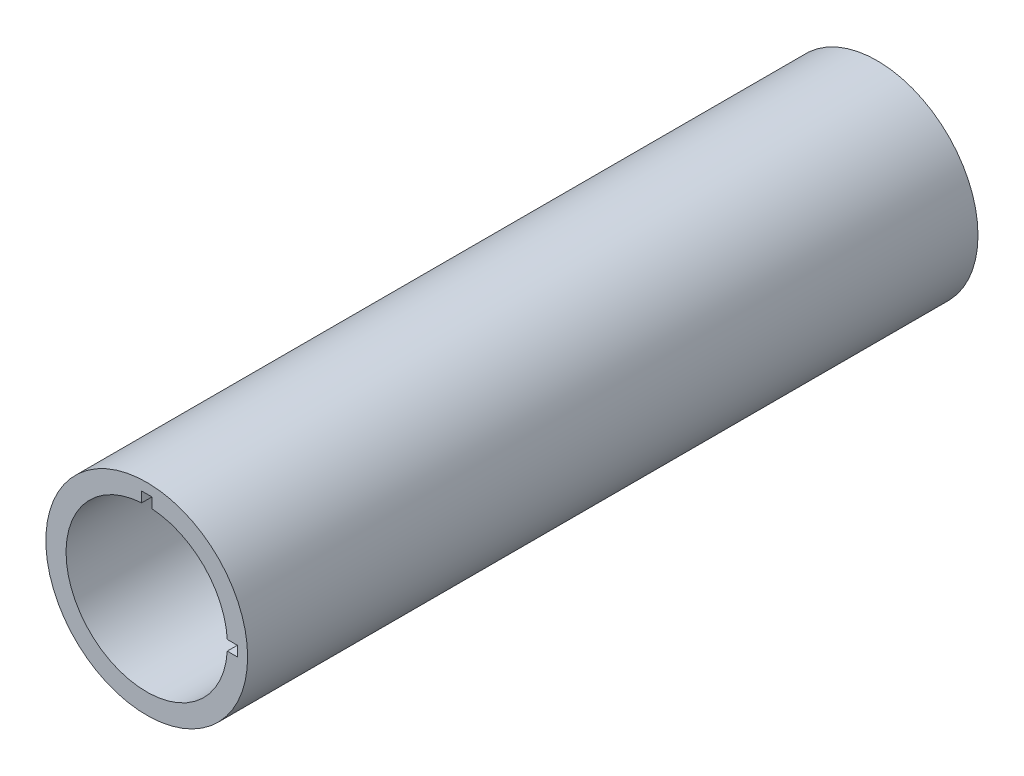
ISO-10303-21;
HEADER;
FILE_DESCRIPTION(('STEP AP214'),'2;1');
FILE_NAME('part.step','',(''),(''),'','','');
FILE_SCHEMA(('AUTOMOTIVE_DESIGN { 1 0 10303 214 1 1 1 1 }'));
ENDSEC;
DATA;
#1=APPLICATION_CONTEXT('core data for automotive mechanical design processes');
#2=APPLICATION_PROTOCOL_DEFINITION('international standard','automotive_design',2000,#1);
#3=PRODUCT_CONTEXT('',#1,'mechanical');
#4=PRODUCT('Part','Part','',(#3));
#5=PRODUCT_RELATED_PRODUCT_CATEGORY('part','',(#4));
#6=PRODUCT_DEFINITION_FORMATION('','',#4);
#7=PRODUCT_DEFINITION_CONTEXT('part definition',#1,'design');
#8=PRODUCT_DEFINITION('design','',#6,#7);
#9=PRODUCT_DEFINITION_SHAPE('','',#8);
#10=(LENGTH_UNIT() NAMED_UNIT(*) SI_UNIT(.MILLI.,.METRE.));
#11=(NAMED_UNIT(*) PLANE_ANGLE_UNIT() SI_UNIT($,.RADIAN.));
#12=(NAMED_UNIT(*) SI_UNIT($,.STERADIAN.) SOLID_ANGLE_UNIT());
#13=UNCERTAINTY_MEASURE_WITH_UNIT(LENGTH_MEASURE(1.E-05),#10,'distance_accuracy_value','');
#14=(GEOMETRIC_REPRESENTATION_CONTEXT(3) GLOBAL_UNCERTAINTY_ASSIGNED_CONTEXT((#13)) GLOBAL_UNIT_ASSIGNED_CONTEXT((#10,
#11,#12)) REPRESENTATION_CONTEXT('',''));
#15=CARTESIAN_POINT('',(0.,0.,0.));
#16=DIRECTION('',(0.,0.,1.));
#17=DIRECTION('',(1.,0.,0.));
#18=AXIS2_PLACEMENT_3D('',#15,#16,#17);
#19=CARTESIAN_POINT('',(0.,0.,181.));
#20=DIRECTION('',(0.,0.,1.));
#21=DIRECTION('',(1.,0.,0.));
#22=AXIS2_PLACEMENT_3D('',#19,#20,#21);
#23=PLANE('',#22);
#24=DIRECTION('',(-1.,0.,0.));
#25=VECTOR('',#24,1.);
#26=CARTESIAN_POINT('',(0.,1.25,181.));
#27=LINE('',#26,#25);
#28=CARTESIAN_POINT('',(22.5,1.24999999999992,181.));
#29=VERTEX_POINT('',#28);
#30=CARTESIAN_POINT('',(19.9608992783391,1.24999999999993,181.));
#31=VERTEX_POINT('',#30);
#32=EDGE_CURVE('E125',#29,#31,#27,.T.);
#33=ORIENTED_EDGE('',*,*,#32,.F.);
#34=DIRECTION('',(0.,-1.,0.));
#35=VECTOR('',#34,1.);
#36=CARTESIAN_POINT('',(22.5,0.,181.));
#37=LINE('',#36,#35);
#38=CARTESIAN_POINT('',(22.5,-1.25000000000008,181.));
#39=VERTEX_POINT('',#38);
#40=EDGE_CURVE('E11',#29,#39,#37,.T.);
#41=ORIENTED_EDGE('',*,*,#40,.T.);
#42=DIRECTION('',(1.,0.,0.));
#43=VECTOR('',#42,1.);
#44=CARTESIAN_POINT('',(0.,-1.25,181.));
#45=LINE('',#44,#43);
#46=CARTESIAN_POINT('',(19.9608992783391,-1.25000000000007,181.));
#47=VERTEX_POINT('',#46);
#48=EDGE_CURVE('E113',#47,#39,#45,.T.);
#49=ORIENTED_EDGE('',*,*,#48,.F.);
#50=CARTESIAN_POINT('',(0.,0.,181.));
#51=DIRECTION('',(0.,0.,1.));
#52=DIRECTION('',(1.,0.,0.));
#53=AXIS2_PLACEMENT_3D('',#50,#51,#52);
#54=CIRCLE('',#53,20.);
#55=CARTESIAN_POINT('',(-1.25,19.9608992783391,181.));
#56=VERTEX_POINT('',#55);
#57=EDGE_CURVE('E143',#56,#47,#54,.T.);
#58=ORIENTED_EDGE('',*,*,#57,.F.);
#59=DIRECTION('',(0.,-1.,0.));
#60=VECTOR('',#59,1.);
#61=CARTESIAN_POINT('',(-1.25,0.,181.));
#62=LINE('',#61,#60);
#63=CARTESIAN_POINT('',(-1.25,22.5,181.));
#64=VERTEX_POINT('',#63);
#65=EDGE_CURVE('E140',#64,#56,#62,.T.);
#66=ORIENTED_EDGE('',*,*,#65,.F.);
#67=DIRECTION('',(1.,0.,0.));
#68=VECTOR('',#67,1.);
#69=CARTESIAN_POINT('',(0.,22.5,181.));
#70=LINE('',#69,#68);
#71=CARTESIAN_POINT('',(1.25,22.5,181.));
#72=VERTEX_POINT('',#71);
#73=EDGE_CURVE('E161',#64,#72,#70,.T.);
#74=ORIENTED_EDGE('',*,*,#73,.T.);
#75=DIRECTION('',(0.,1.,0.));
#76=VECTOR('',#75,1.);
#77=CARTESIAN_POINT('',(1.25,0.,181.));
#78=LINE('',#77,#76);
#79=CARTESIAN_POINT('',(1.25,19.9608992783391,181.));
#80=VERTEX_POINT('',#79);
#81=EDGE_CURVE('E137',#80,#72,#78,.T.);
#82=ORIENTED_EDGE('',*,*,#81,.F.);
#83=EDGE_CURVE('E147',#31,#80,#54,.T.);
#84=ORIENTED_EDGE('',*,*,#83,.F.);
#85=EDGE_LOOP('',(#33,#41,#49,#58,#66,#74,#82,#84));
#86=FACE_BOUND('',#85,.T.);
#87=CARTESIAN_POINT('',(0.,0.,181.));
#88=DIRECTION('',(0.,0.,1.));
#89=DIRECTION('',(1.,0.,0.));
#90=AXIS2_PLACEMENT_3D('',#87,#88,#89);
#91=CIRCLE('',#90,25.);
#92=CARTESIAN_POINT('',(25.,0.,181.));
#93=VERTEX_POINT('',#92);
#94=EDGE_CURVE('E150',#93,#93,#91,.T.);
#95=ORIENTED_EDGE('',*,*,#94,.T.);
#96=EDGE_LOOP('',(#95));
#97=FACE_BOUND('',#96,.T.);
#98=ADVANCED_FACE('F35',(#86,#97),#23,.T.);
#99=CARTESIAN_POINT('',(0.,0.,0.));
#100=DIRECTION('',(0.,0.,1.));
#101=DIRECTION('',(1.,0.,0.));
#102=AXIS2_PLACEMENT_3D('',#99,#100,#101);
#103=PLANE('',#102);
#104=CARTESIAN_POINT('',(0.,0.,0.));
#105=DIRECTION('',(0.,0.,1.));
#106=DIRECTION('',(1.,0.,0.));
#107=AXIS2_PLACEMENT_3D('',#104,#105,#106);
#108=CIRCLE('',#107,25.);
#109=CARTESIAN_POINT('',(25.,0.,0.));
#110=VERTEX_POINT('',#109);
#111=EDGE_CURVE('E146',#110,#110,#108,.T.);
#112=ORIENTED_EDGE('',*,*,#111,.F.);
#113=EDGE_LOOP('',(#112));
#114=FACE_BOUND('',#113,.T.);
#115=CARTESIAN_POINT('',(0.,0.,0.));
#116=DIRECTION('',(0.,0.,1.));
#117=DIRECTION('',(1.,0.,0.));
#118=AXIS2_PLACEMENT_3D('',#115,#116,#117);
#119=CIRCLE('',#118,20.);
#120=CARTESIAN_POINT('',(20.,0.,0.));
#121=VERTEX_POINT('',#120);
#122=EDGE_CURVE('E142',#121,#121,#119,.T.);
#123=ORIENTED_EDGE('',*,*,#122,.T.);
#124=EDGE_LOOP('',(#123));
#125=FACE_BOUND('',#124,.T.);
#126=ADVANCED_FACE('F203',(#114,#125),#103,.F.);
#127=CARTESIAN_POINT('',(0.,0.,181.));
#128=DIRECTION('',(0.,0.,-1.));
#129=DIRECTION('',(-1.,0.,0.));
#130=AXIS2_PLACEMENT_3D('',#127,#128,#129);
#131=CYLINDRICAL_SURFACE('',#130,25.);
#132=ORIENTED_EDGE('',*,*,#94,.F.);
#133=EDGE_LOOP('',(#132));
#134=FACE_BOUND('',#133,.T.);
#135=ORIENTED_EDGE('',*,*,#111,.T.);
#136=EDGE_LOOP('',(#135));
#137=FACE_BOUND('',#136,.T.);
#138=ADVANCED_FACE('F37',(#134,#137),#131,.T.);
#139=CARTESIAN_POINT('',(0.,0.,181.));
#140=DIRECTION('',(0.,0.,-1.));
#141=DIRECTION('',(-1.,0.,0.));
#142=AXIS2_PLACEMENT_3D('',#139,#140,#141);
#143=CYLINDRICAL_SURFACE('',#142,20.);
#144=DIRECTION('',(0.,0.,-1.));
#145=VECTOR('',#144,1.);
#146=CARTESIAN_POINT('',(19.9608992783391,1.24999999999993,181.));
#147=LINE('',#146,#145);
#148=CARTESIAN_POINT('',(19.9608992783391,1.24999999999993,151.230203819275));
#149=VERTEX_POINT('',#148);
#150=EDGE_CURVE('E43',#31,#149,#147,.T.);
#151=ORIENTED_EDGE('',*,*,#150,.F.);
#152=ORIENTED_EDGE('',*,*,#83,.T.);
#153=DIRECTION('',(0.,0.,-1.));
#154=VECTOR('',#153,1.);
#155=CARTESIAN_POINT('',(1.25,19.9608992783391,181.));
#156=LINE('',#155,#154);
#157=CARTESIAN_POINT('',(1.25,19.9608992783391,151.230203819275));
#158=VERTEX_POINT('',#157);
#159=EDGE_CURVE('E153',#158,#80,#156,.F.);
#160=ORIENTED_EDGE('',*,*,#159,.F.);
#161=CARTESIAN_POINT('',(0.,0.,151.230203819275));
#162=DIRECTION('',(0.,0.,-1.));
#163=DIRECTION('',(-1.,0.,0.));
#164=AXIS2_PLACEMENT_3D('',#161,#162,#163);
#165=CIRCLE('',#164,20.);
#166=CARTESIAN_POINT('',(-1.25,19.9608992783391,151.230203819275));
#167=VERTEX_POINT('',#166);
#168=EDGE_CURVE('E157',#167,#158,#165,.T.);
#169=ORIENTED_EDGE('',*,*,#168,.F.);
#170=DIRECTION('',(0.,0.,-1.));
#171=VECTOR('',#170,1.);
#172=CARTESIAN_POINT('',(-1.25,19.9608992783391,181.));
#173=LINE('',#172,#171);
#174=EDGE_CURVE('E159',#56,#167,#173,.T.);
#175=ORIENTED_EDGE('',*,*,#174,.F.);
#176=ORIENTED_EDGE('',*,*,#57,.T.);
#177=DIRECTION('',(0.,0.,-1.));
#178=VECTOR('',#177,1.);
#179=CARTESIAN_POINT('',(19.9608992783391,-1.25000000000007,181.));
#180=LINE('',#179,#178);
#181=CARTESIAN_POINT('',(19.9608992783391,-1.25000000000007,151.230203819275));
#182=VERTEX_POINT('',#181);
#183=EDGE_CURVE('E164',#182,#47,#180,.F.);
#184=ORIENTED_EDGE('',*,*,#183,.F.);
#185=CARTESIAN_POINT('',(0.,0.,151.230203819275));
#186=DIRECTION('',(0.,0.,-1.));
#187=DIRECTION('',(-1.,0.,0.));
#188=AXIS2_PLACEMENT_3D('',#185,#186,#187);
#189=CIRCLE('',#188,20.);
#190=EDGE_CURVE('E105',#149,#182,#189,.T.);
#191=ORIENTED_EDGE('',*,*,#190,.F.);
#192=EDGE_LOOP('',(#151,#152,#160,#169,#175,#176,#184,#191));
#193=FACE_BOUND('',#192,.T.);
#194=ORIENTED_EDGE('',*,*,#122,.F.);
#195=EDGE_LOOP('',(#194));
#196=FACE_BOUND('',#195,.T.);
#197=ADVANCED_FACE('F172',(#193,#196),#143,.F.);
#198=CARTESIAN_POINT('',(-1.25,16.4999999999999,151.230203819275));
#199=DIRECTION('',(-1.,0.,0.));
#200=DIRECTION('',(0.,0.,1.));
#201=AXIS2_PLACEMENT_3D('',#198,#199,#200);
#202=PLANE('',#201);
#203=ORIENTED_EDGE('',*,*,#65,.T.);
#204=ORIENTED_EDGE('',*,*,#174,.T.);
#205=DIRECTION('',(0.,1.,0.));
#206=VECTOR('',#205,1.);
#207=CARTESIAN_POINT('',(-1.25,16.4999999999999,151.230203819275));
#208=LINE('',#207,#206);
#209=CARTESIAN_POINT('',(-1.25,22.5,151.230203819275));
#210=VERTEX_POINT('',#209);
#211=EDGE_CURVE('E135',#167,#210,#208,.T.);
#212=ORIENTED_EDGE('',*,*,#211,.T.);
#213=DIRECTION('',(0.,0.,1.));
#214=VECTOR('',#213,1.);
#215=CARTESIAN_POINT('',(-1.25,22.5,151.230203819275));
#216=LINE('',#215,#214);
#217=EDGE_CURVE('E127',#210,#64,#216,.T.);
#218=ORIENTED_EDGE('',*,*,#217,.T.);
#219=EDGE_LOOP('',(#203,#204,#212,#218));
#220=FACE_BOUND('',#219,.T.);
#221=ADVANCED_FACE('F189',(#220),#202,.F.);
#222=CARTESIAN_POINT('',(1.25,16.4999999999999,151.230203819275));
#223=DIRECTION('',(0.,0.,-1.));
#224=DIRECTION('',(-1.,0.,0.));
#225=AXIS2_PLACEMENT_3D('',#222,#223,#224);
#226=PLANE('',#225);
#227=ORIENTED_EDGE('',*,*,#168,.T.);
#228=DIRECTION('',(0.,1.,0.));
#229=VECTOR('',#228,1.);
#230=CARTESIAN_POINT('',(1.25,16.4999999999999,151.230203819275));
#231=LINE('',#230,#229);
#232=CARTESIAN_POINT('',(1.25,22.5,151.230203819275));
#233=VERTEX_POINT('',#232);
#234=EDGE_CURVE('E58',#158,#233,#231,.T.);
#235=ORIENTED_EDGE('',*,*,#234,.T.);
#236=DIRECTION('',(-1.,0.,0.));
#237=VECTOR('',#236,1.);
#238=CARTESIAN_POINT('',(1.25,22.5,151.230203819275));
#239=LINE('',#238,#237);
#240=EDGE_CURVE('E132',#233,#210,#239,.T.);
#241=ORIENTED_EDGE('',*,*,#240,.T.);
#242=ORIENTED_EDGE('',*,*,#211,.F.);
#243=EDGE_LOOP('',(#227,#235,#241,#242));
#244=FACE_BOUND('',#243,.T.);
#245=ADVANCED_FACE('F192',(#244),#226,.F.);
#246=CARTESIAN_POINT('',(1.25,16.4999999999999,151.230203819275));
#247=DIRECTION('',(1.,0.,0.));
#248=DIRECTION('',(0.,0.,-1.));
#249=AXIS2_PLACEMENT_3D('',#246,#247,#248);
#250=PLANE('',#249);
#251=ORIENTED_EDGE('',*,*,#81,.T.);
#252=DIRECTION('',(0.,0.,-1.));
#253=VECTOR('',#252,1.);
#254=CARTESIAN_POINT('',(1.25,22.5,151.230203819275));
#255=LINE('',#254,#253);
#256=EDGE_CURVE('E130',#72,#233,#255,.T.);
#257=ORIENTED_EDGE('',*,*,#256,.T.);
#258=ORIENTED_EDGE('',*,*,#234,.F.);
#259=ORIENTED_EDGE('',*,*,#159,.T.);
#260=EDGE_LOOP('',(#251,#257,#258,#259));
#261=FACE_BOUND('',#260,.T.);
#262=ADVANCED_FACE('F182',(#261),#250,.F.);
#263=CARTESIAN_POINT('',(-1.25,22.5,181.230203819275));
#264=DIRECTION('',(0.,-1.,0.));
#265=DIRECTION('',(0.,0.,-1.));
#266=AXIS2_PLACEMENT_3D('',#263,#264,#265);
#267=PLANE('',#266);
#268=ORIENTED_EDGE('',*,*,#217,.F.);
#269=ORIENTED_EDGE('',*,*,#240,.F.);
#270=ORIENTED_EDGE('',*,*,#256,.F.);
#271=ORIENTED_EDGE('',*,*,#73,.F.);
#272=EDGE_LOOP('',(#268,#269,#270,#271));
#273=FACE_BOUND('',#272,.T.);
#274=ADVANCED_FACE('F187',(#273),#267,.T.);
#275=CARTESIAN_POINT('',(16.4999999999999,1.24999999999994,151.230203819275));
#276=DIRECTION('',(0.,1.,0.));
#277=DIRECTION('',(-1.,0.,0.));
#278=AXIS2_PLACEMENT_3D('',#275,#276,#277);
#279=PLANE('',#278);
#280=ORIENTED_EDGE('',*,*,#32,.T.);
#281=ORIENTED_EDGE('',*,*,#150,.T.);
#282=DIRECTION('',(1.,0.,0.));
#283=VECTOR('',#282,1.);
#284=CARTESIAN_POINT('',(16.4999999999999,1.24999999999994,151.230203819275));
#285=LINE('',#284,#283);
#286=CARTESIAN_POINT('',(22.5,1.24999999999992,151.230203819275));
#287=VERTEX_POINT('',#286);
#288=EDGE_CURVE('E107',#149,#287,#285,.T.);
#289=ORIENTED_EDGE('',*,*,#288,.T.);
#290=DIRECTION('',(0.,0.,1.));
#291=VECTOR('',#290,1.);
#292=CARTESIAN_POINT('',(22.5,1.24999999999992,151.230203819275));
#293=LINE('',#292,#291);
#294=EDGE_CURVE('E115',#287,#29,#293,.T.);
#295=ORIENTED_EDGE('',*,*,#294,.T.);
#296=EDGE_LOOP('',(#280,#281,#289,#295));
#297=FACE_BOUND('',#296,.T.);
#298=ADVANCED_FACE('F168',(#297),#279,.F.);
#299=CARTESIAN_POINT('',(16.4999999999999,-1.25000000000006,151.230203819275));
#300=DIRECTION('',(0.,0.,-1.));
#301=DIRECTION('',(-1.,0.,0.));
#302=AXIS2_PLACEMENT_3D('',#299,#300,#301);
#303=PLANE('',#302);
#304=ORIENTED_EDGE('',*,*,#190,.T.);
#305=DIRECTION('',(1.,0.,0.));
#306=VECTOR('',#305,1.);
#307=CARTESIAN_POINT('',(16.4999999999999,-1.25000000000006,151.230203819275));
#308=LINE('',#307,#306);
#309=CARTESIAN_POINT('',(22.5,-1.25000000000008,151.230203819275));
#310=VERTEX_POINT('',#309);
#311=EDGE_CURVE('E50',#182,#310,#308,.T.);
#312=ORIENTED_EDGE('',*,*,#311,.T.);
#313=DIRECTION('',(0.,1.,0.));
#314=VECTOR('',#313,1.);
#315=CARTESIAN_POINT('',(22.5,-1.25000000000008,151.230203819275));
#316=LINE('',#315,#314);
#317=EDGE_CURVE('E103',#310,#287,#316,.T.);
#318=ORIENTED_EDGE('',*,*,#317,.T.);
#319=ORIENTED_EDGE('',*,*,#288,.F.);
#320=EDGE_LOOP('',(#304,#312,#318,#319));
#321=FACE_BOUND('',#320,.T.);
#322=ADVANCED_FACE('F100',(#321),#303,.F.);
#323=CARTESIAN_POINT('',(16.4999999999999,-1.25000000000006,151.230203819275));
#324=DIRECTION('',(0.,-1.,0.));
#325=DIRECTION('',(1.,0.,0.));
#326=AXIS2_PLACEMENT_3D('',#323,#324,#325);
#327=PLANE('',#326);
#328=ORIENTED_EDGE('',*,*,#48,.T.);
#329=DIRECTION('',(0.,0.,-1.));
#330=VECTOR('',#329,1.);
#331=CARTESIAN_POINT('',(22.5,-1.25000000000008,151.230203819275));
#332=LINE('',#331,#330);
#333=EDGE_CURVE('E110',#39,#310,#332,.T.);
#334=ORIENTED_EDGE('',*,*,#333,.T.);
#335=ORIENTED_EDGE('',*,*,#311,.F.);
#336=ORIENTED_EDGE('',*,*,#183,.T.);
#337=EDGE_LOOP('',(#328,#334,#335,#336));
#338=FACE_BOUND('',#337,.T.);
#339=ADVANCED_FACE('F111',(#338),#327,.F.);
#340=CARTESIAN_POINT('',(22.5,1.24999999999992,181.230203819275));
#341=DIRECTION('',(-1.,0.,0.));
#342=DIRECTION('',(0.,0.,-1.));
#343=AXIS2_PLACEMENT_3D('',#340,#341,#342);
#344=PLANE('',#343);
#345=ORIENTED_EDGE('',*,*,#294,.F.);
#346=ORIENTED_EDGE('',*,*,#317,.F.);
#347=ORIENTED_EDGE('',*,*,#333,.F.);
#348=ORIENTED_EDGE('',*,*,#40,.F.);
#349=EDGE_LOOP('',(#345,#346,#347,#348));
#350=FACE_BOUND('',#349,.T.);
#351=ADVANCED_FACE('F118',(#350),#344,.T.);
#352=CLOSED_SHELL('',(#98,#126,#138,#197,#221,#245,#262,#274,#298,#322,#339,#351));
#353=MANIFOLD_SOLID_BREP('B2',#352);
#354=ADVANCED_BREP_SHAPE_REPRESENTATION('',(#18,#353),#14);
#355=SHAPE_DEFINITION_REPRESENTATION(#9,#354);
ENDSEC;
END-ISO-10303-21;
